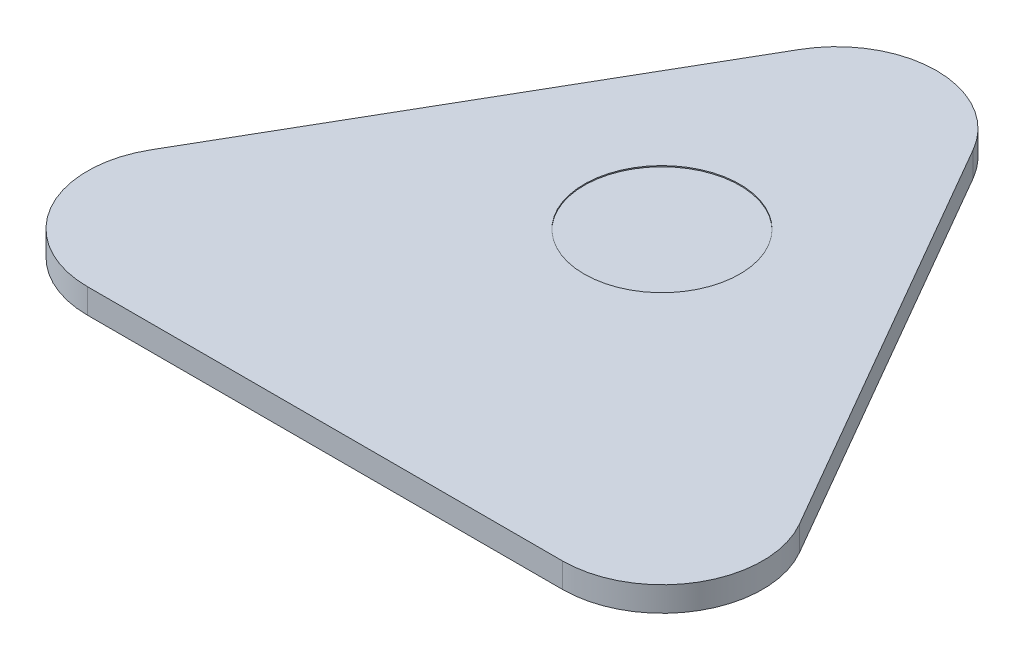
ISO-10303-21;
HEADER;
FILE_DESCRIPTION(('STEP AP214'),'2;1');
FILE_NAME('part.step','',(''),(''),'','','');
FILE_SCHEMA(('AUTOMOTIVE_DESIGN { 1 0 10303 214 1 1 1 1 }'));
ENDSEC;
DATA;
#1=APPLICATION_CONTEXT('core data for automotive mechanical design processes');
#2=APPLICATION_PROTOCOL_DEFINITION('international standard','automotive_design',2000,#1);
#3=PRODUCT_CONTEXT('',#1,'mechanical');
#4=PRODUCT('Part','Part','',(#3));
#5=PRODUCT_RELATED_PRODUCT_CATEGORY('part','',(#4));
#6=PRODUCT_DEFINITION_FORMATION('','',#4);
#7=PRODUCT_DEFINITION_CONTEXT('part definition',#1,'design');
#8=PRODUCT_DEFINITION('design','',#6,#7);
#9=PRODUCT_DEFINITION_SHAPE('','',#8);
#10=(LENGTH_UNIT() NAMED_UNIT(*) SI_UNIT(.MILLI.,.METRE.));
#11=(NAMED_UNIT(*) PLANE_ANGLE_UNIT() SI_UNIT($,.RADIAN.));
#12=(NAMED_UNIT(*) SI_UNIT($,.STERADIAN.) SOLID_ANGLE_UNIT());
#13=UNCERTAINTY_MEASURE_WITH_UNIT(LENGTH_MEASURE(1.E-05),#10,'distance_accuracy_value','');
#14=(GEOMETRIC_REPRESENTATION_CONTEXT(3) GLOBAL_UNCERTAINTY_ASSIGNED_CONTEXT((#13)) GLOBAL_UNIT_ASSIGNED_CONTEXT((#10,
#11,#12)) REPRESENTATION_CONTEXT('',''));
#15=CARTESIAN_POINT('',(0.,0.,0.));
#16=DIRECTION('',(0.,0.,1.));
#17=DIRECTION('',(1.,0.,0.));
#18=AXIS2_PLACEMENT_3D('',#15,#16,#17);
#19=CARTESIAN_POINT('',(0.,2.38125,-26.4137748154254));
#20=DIRECTION('',(0.,-1.,0.));
#21=DIRECTION('',(0.,0.,-1.));
#22=AXIS2_PLACEMENT_3D('',#19,#20,#21);
#23=CYLINDRICAL_SURFACE('',#22,9.64999999999999);
#24=CARTESIAN_POINT('',(0.,0.,-26.4137748154254));
#25=DIRECTION('',(0.,1.,0.));
#26=DIRECTION('',(0.,0.,-1.));
#27=AXIS2_PLACEMENT_3D('',#24,#25,#26);
#28=CIRCLE('',#27,9.64999999999999);
#29=CARTESIAN_POINT('',(8.35714514651982,0.,-31.2387748154254));
#30=VERTEX_POINT('',#29);
#31=CARTESIAN_POINT('',(-8.35714514651983,0.,-31.2387748154254));
#32=VERTEX_POINT('',#31);
#33=EDGE_CURVE('E118',#30,#32,#28,.T.);
#34=ORIENTED_EDGE('',*,*,#33,.T.);
#35=DIRECTION('',(0.,-1.,0.));
#36=VECTOR('',#35,1.);
#37=CARTESIAN_POINT('',(-8.35714514651983,2.38125,-31.2387748154254));
#38=LINE('',#37,#36);
#39=CARTESIAN_POINT('',(-8.35714514651983,2.38125,-31.2387748154254));
#40=VERTEX_POINT('',#39);
#41=EDGE_CURVE('E11',#40,#32,#38,.T.);
#42=ORIENTED_EDGE('',*,*,#41,.F.);
#43=CARTESIAN_POINT('',(0.,2.38125,-26.4137748154254));
#44=DIRECTION('',(0.,1.,0.));
#45=DIRECTION('',(0.,0.,-1.));
#46=AXIS2_PLACEMENT_3D('',#43,#44,#45);
#47=CIRCLE('',#46,9.64999999999999);
#48=CARTESIAN_POINT('',(8.35714514651982,2.38125,-31.2387748154254));
#49=VERTEX_POINT('',#48);
#50=EDGE_CURVE('E129',#49,#40,#47,.T.);
#51=ORIENTED_EDGE('',*,*,#50,.F.);
#52=DIRECTION('',(0.,-1.,0.));
#53=VECTOR('',#52,1.);
#54=CARTESIAN_POINT('',(8.35714514651982,2.38125,-31.2387748154254));
#55=LINE('',#54,#53);
#56=EDGE_CURVE('E114',#49,#30,#55,.T.);
#57=ORIENTED_EDGE('',*,*,#56,.T.);
#58=EDGE_LOOP('',(#34,#42,#51,#57));
#59=FACE_BOUND('',#58,.T.);
#60=ADVANCED_FACE('F34',(#59),#23,.T.);
#61=CARTESIAN_POINT('',(-8.35714514651983,2.38125,-31.2387748154254));
#62=DIRECTION('',(0.866025403784439,0.,0.5));
#63=DIRECTION('',(0.5,0.,-0.866025403784439));
#64=AXIS2_PLACEMENT_3D('',#61,#62,#63);
#65=PLANE('',#64);
#66=DIRECTION('',(-0.5,0.,0.866025403784439));
#67=VECTOR('',#66,1.);
#68=CARTESIAN_POINT('',(-8.35714514651983,0.,-31.2387748154254));
#69=LINE('',#68,#67);
#70=CARTESIAN_POINT('',(-31.2321451465198,0.,8.38188740771269));
#71=VERTEX_POINT('',#70);
#72=EDGE_CURVE('E121',#32,#71,#69,.T.);
#73=ORIENTED_EDGE('',*,*,#72,.T.);
#74=DIRECTION('',(0.,-1.,0.));
#75=VECTOR('',#74,1.);
#76=CARTESIAN_POINT('',(-31.2321451465198,2.38125,8.38188740771269));
#77=LINE('',#76,#75);
#78=CARTESIAN_POINT('',(-31.2321451465198,2.38125,8.38188740771269));
#79=VERTEX_POINT('',#78);
#80=EDGE_CURVE('E42',#79,#71,#77,.T.);
#81=ORIENTED_EDGE('',*,*,#80,.F.);
#82=DIRECTION('',(-0.5,0.,0.866025403784439));
#83=VECTOR('',#82,1.);
#84=CARTESIAN_POINT('',(-8.35714514651983,2.38125,-31.2387748154254));
#85=LINE('',#84,#83);
#86=EDGE_CURVE('E87',#40,#79,#85,.T.);
#87=ORIENTED_EDGE('',*,*,#86,.F.);
#88=ORIENTED_EDGE('',*,*,#41,.T.);
#89=EDGE_LOOP('',(#73,#81,#87,#88));
#90=FACE_BOUND('',#89,.T.);
#91=ADVANCED_FACE('F155',(#90),#65,.F.);
#92=CARTESIAN_POINT('',(-22.875,2.38125,13.2068874077127));
#93=DIRECTION('',(0.,-1.,0.));
#94=DIRECTION('',(0.,0.,-1.));
#95=AXIS2_PLACEMENT_3D('',#92,#93,#94);
#96=CYLINDRICAL_SURFACE('',#95,9.65);
#97=CARTESIAN_POINT('',(-22.875,0.,13.2068874077127));
#98=DIRECTION('',(0.,1.,0.));
#99=DIRECTION('',(0.,0.,1.));
#100=AXIS2_PLACEMENT_3D('',#97,#98,#99);
#101=CIRCLE('',#100,9.65);
#102=CARTESIAN_POINT('',(-22.875,0.,22.8568874077127));
#103=VERTEX_POINT('',#102);
#104=EDGE_CURVE('E124',#71,#103,#101,.T.);
#105=ORIENTED_EDGE('',*,*,#104,.T.);
#106=DIRECTION('',(0.,-1.,0.));
#107=VECTOR('',#106,1.);
#108=CARTESIAN_POINT('',(-22.875,2.38125,22.8568874077127));
#109=LINE('',#108,#107);
#110=CARTESIAN_POINT('',(-22.875,2.38125,22.8568874077127));
#111=VERTEX_POINT('',#110);
#112=EDGE_CURVE('E109',#111,#103,#109,.T.);
#113=ORIENTED_EDGE('',*,*,#112,.F.);
#114=CARTESIAN_POINT('',(-22.875,2.38125,13.2068874077127));
#115=DIRECTION('',(0.,1.,0.));
#116=DIRECTION('',(0.,0.,1.));
#117=AXIS2_PLACEMENT_3D('',#114,#115,#116);
#118=CIRCLE('',#117,9.65);
#119=EDGE_CURVE('E100',#79,#111,#118,.T.);
#120=ORIENTED_EDGE('',*,*,#119,.F.);
#121=ORIENTED_EDGE('',*,*,#80,.T.);
#122=EDGE_LOOP('',(#105,#113,#120,#121));
#123=FACE_BOUND('',#122,.T.);
#124=ADVANCED_FACE('F135',(#123),#96,.T.);
#125=CARTESIAN_POINT('',(-22.875,2.38125,22.8568874077127));
#126=DIRECTION('',(0.,0.,-1.));
#127=DIRECTION('',(-1.,0.,0.));
#128=AXIS2_PLACEMENT_3D('',#125,#126,#127);
#129=PLANE('',#128);
#130=DIRECTION('',(1.,0.,0.));
#131=VECTOR('',#130,1.);
#132=CARTESIAN_POINT('',(-22.875,0.,22.8568874077127));
#133=LINE('',#132,#131);
#134=CARTESIAN_POINT('',(22.875,0.,22.8568874077127));
#135=VERTEX_POINT('',#134);
#136=EDGE_CURVE('E108',#103,#135,#133,.T.);
#137=ORIENTED_EDGE('',*,*,#136,.T.);
#138=DIRECTION('',(0.,-1.,0.));
#139=VECTOR('',#138,1.);
#140=CARTESIAN_POINT('',(22.875,2.38125,22.8568874077127));
#141=LINE('',#140,#139);
#142=CARTESIAN_POINT('',(22.875,2.38125,22.8568874077127));
#143=VERTEX_POINT('',#142);
#144=EDGE_CURVE('E105',#143,#135,#141,.T.);
#145=ORIENTED_EDGE('',*,*,#144,.F.);
#146=DIRECTION('',(1.,0.,0.));
#147=VECTOR('',#146,1.);
#148=CARTESIAN_POINT('',(-22.875,2.38125,22.8568874077127));
#149=LINE('',#148,#147);
#150=EDGE_CURVE('E94',#111,#143,#149,.T.);
#151=ORIENTED_EDGE('',*,*,#150,.F.);
#152=ORIENTED_EDGE('',*,*,#112,.T.);
#153=EDGE_LOOP('',(#137,#145,#151,#152));
#154=FACE_BOUND('',#153,.T.);
#155=ADVANCED_FACE('F106',(#154),#129,.F.);
#156=CARTESIAN_POINT('',(22.875,2.38125,13.2068874077127));
#157=DIRECTION('',(0.,-1.,0.));
#158=DIRECTION('',(0.,0.,-1.));
#159=AXIS2_PLACEMENT_3D('',#156,#157,#158);
#160=CYLINDRICAL_SURFACE('',#159,9.65);
#161=CARTESIAN_POINT('',(22.875,0.,13.2068874077127));
#162=DIRECTION('',(0.,1.,0.));
#163=DIRECTION('',(0.,0.,1.));
#164=AXIS2_PLACEMENT_3D('',#161,#162,#163);
#165=CIRCLE('',#164,9.65);
#166=CARTESIAN_POINT('',(31.2321451465198,0.,8.3818874077127));
#167=VERTEX_POINT('',#166);
#168=EDGE_CURVE('E73',#135,#167,#165,.T.);
#169=ORIENTED_EDGE('',*,*,#168,.T.);
#170=DIRECTION('',(0.,-1.,0.));
#171=VECTOR('',#170,1.);
#172=CARTESIAN_POINT('',(31.2321451465198,2.38125,8.3818874077127));
#173=LINE('',#172,#171);
#174=CARTESIAN_POINT('',(31.2321451465198,2.38125,8.3818874077127));
#175=VERTEX_POINT('',#174);
#176=EDGE_CURVE('E110',#175,#167,#173,.T.);
#177=ORIENTED_EDGE('',*,*,#176,.F.);
#178=CARTESIAN_POINT('',(22.875,2.38125,13.2068874077127));
#179=DIRECTION('',(0.,1.,0.));
#180=DIRECTION('',(0.,0.,1.));
#181=AXIS2_PLACEMENT_3D('',#178,#179,#180);
#182=CIRCLE('',#181,9.65);
#183=EDGE_CURVE('E98',#143,#175,#182,.T.);
#184=ORIENTED_EDGE('',*,*,#183,.F.);
#185=ORIENTED_EDGE('',*,*,#144,.T.);
#186=EDGE_LOOP('',(#169,#177,#184,#185));
#187=FACE_BOUND('',#186,.T.);
#188=ADVANCED_FACE('F112',(#187),#160,.T.);
#189=CARTESIAN_POINT('',(31.2321451465198,2.38125,8.3818874077127));
#190=DIRECTION('',(-0.866025403784439,0.,0.5));
#191=DIRECTION('',(0.5,0.,0.866025403784439));
#192=AXIS2_PLACEMENT_3D('',#189,#190,#191);
#193=PLANE('',#192);
#194=DIRECTION('',(-0.5,0.,-0.866025403784439));
#195=VECTOR('',#194,1.);
#196=CARTESIAN_POINT('',(31.2321451465198,0.,8.3818874077127));
#197=LINE('',#196,#195);
#198=EDGE_CURVE('E79',#167,#30,#197,.T.);
#199=ORIENTED_EDGE('',*,*,#198,.T.);
#200=ORIENTED_EDGE('',*,*,#56,.F.);
#201=DIRECTION('',(-0.5,0.,-0.866025403784439));
#202=VECTOR('',#201,1.);
#203=CARTESIAN_POINT('',(31.2321451465198,2.38125,8.3818874077127));
#204=LINE('',#203,#202);
#205=EDGE_CURVE('E50',#175,#49,#204,.T.);
#206=ORIENTED_EDGE('',*,*,#205,.F.);
#207=ORIENTED_EDGE('',*,*,#176,.T.);
#208=EDGE_LOOP('',(#199,#200,#206,#207));
#209=FACE_BOUND('',#208,.T.);
#210=ADVANCED_FACE('F142',(#209),#193,.F.);
#211=CARTESIAN_POINT('',(0.,2.38125,-26.4137748154254));
#212=DIRECTION('',(0.,-1.,0.));
#213=DIRECTION('',(0.,0.,-1.));
#214=AXIS2_PLACEMENT_3D('',#211,#212,#213);
#215=PLANE('',#214);
#216=CARTESIAN_POINT('',(0.,2.38125,-9.61377481542539));
#217=DIRECTION('',(0.,1.,0.));
#218=DIRECTION('',(0.,0.,1.));
#219=AXIS2_PLACEMENT_3D('',#216,#217,#218);
#220=CIRCLE('',#219,7.5);
#221=CARTESIAN_POINT('',(0.,2.38125,-2.11377481542539));
#222=VERTEX_POINT('',#221);
#223=EDGE_CURVE('E213',#222,#222,#220,.T.);
#224=ORIENTED_EDGE('',*,*,#223,.F.);
#225=EDGE_LOOP('',(#224));
#226=FACE_BOUND('',#225,.T.);
#227=ORIENTED_EDGE('',*,*,#50,.T.);
#228=ORIENTED_EDGE('',*,*,#86,.T.);
#229=ORIENTED_EDGE('',*,*,#119,.T.);
#230=ORIENTED_EDGE('',*,*,#150,.T.);
#231=ORIENTED_EDGE('',*,*,#183,.T.);
#232=ORIENTED_EDGE('',*,*,#205,.T.);
#233=EDGE_LOOP('',(#227,#228,#229,#230,#231,#232));
#234=FACE_BOUND('',#233,.T.);
#235=ADVANCED_FACE('F96',(#226,#234),#215,.F.);
#236=CARTESIAN_POINT('',(0.,0.,-26.4137748154254));
#237=DIRECTION('',(0.,-1.,0.));
#238=DIRECTION('',(0.,0.,-1.));
#239=AXIS2_PLACEMENT_3D('',#236,#237,#238);
#240=PLANE('',#239);
#241=ORIENTED_EDGE('',*,*,#33,.F.);
#242=ORIENTED_EDGE('',*,*,#198,.F.);
#243=ORIENTED_EDGE('',*,*,#168,.F.);
#244=ORIENTED_EDGE('',*,*,#136,.F.);
#245=ORIENTED_EDGE('',*,*,#104,.F.);
#246=ORIENTED_EDGE('',*,*,#72,.F.);
#247=EDGE_LOOP('',(#241,#242,#243,#244,#245,#246));
#248=FACE_BOUND('',#247,.T.);
#249=ADVANCED_FACE('F138',(#248),#240,.T.);
#250=CARTESIAN_POINT('',(0.,2.28125,-9.61377481542539));
#251=DIRECTION('',(0.,1.,0.));
#252=DIRECTION('',(0.,0.,1.));
#253=AXIS2_PLACEMENT_3D('',#250,#251,#252);
#254=CYLINDRICAL_SURFACE('',#253,7.5);
#255=CARTESIAN_POINT('',(0.,2.28125,-9.61377481542539));
#256=DIRECTION('',(0.,1.,0.));
#257=DIRECTION('',(0.,0.,1.));
#258=AXIS2_PLACEMENT_3D('',#255,#256,#257);
#259=CIRCLE('',#258,7.5);
#260=CARTESIAN_POINT('',(0.,2.28125,-2.11377481542539));
#261=VERTEX_POINT('',#260);
#262=EDGE_CURVE('E122',#261,#261,#259,.T.);
#263=ORIENTED_EDGE('',*,*,#262,.F.);
#264=EDGE_LOOP('',(#263));
#265=FACE_BOUND('',#264,.T.);
#266=ORIENTED_EDGE('',*,*,#223,.T.);
#267=EDGE_LOOP('',(#266));
#268=FACE_BOUND('',#267,.T.);
#269=ADVANCED_FACE('F186',(#265,#268),#254,.F.);
#270=CARTESIAN_POINT('',(0.,2.28125,-9.61377481542539));
#271=DIRECTION('',(0.,1.,0.));
#272=DIRECTION('',(0.,0.,1.));
#273=AXIS2_PLACEMENT_3D('',#270,#271,#272);
#274=PLANE('',#273);
#275=ORIENTED_EDGE('',*,*,#262,.T.);
#276=EDGE_LOOP('',(#275));
#277=FACE_BOUND('',#276,.T.);
#278=ADVANCED_FACE('F197',(#277),#274,.T.);
#279=CLOSED_SHELL('',(#60,#91,#124,#155,#188,#210,#235,#249,#269,#278));
#280=MANIFOLD_SOLID_BREP('B2',#279);
#281=ADVANCED_BREP_SHAPE_REPRESENTATION('',(#18,#280),#14);
#282=SHAPE_DEFINITION_REPRESENTATION(#9,#281);
ENDSEC;
END-ISO-10303-21;
